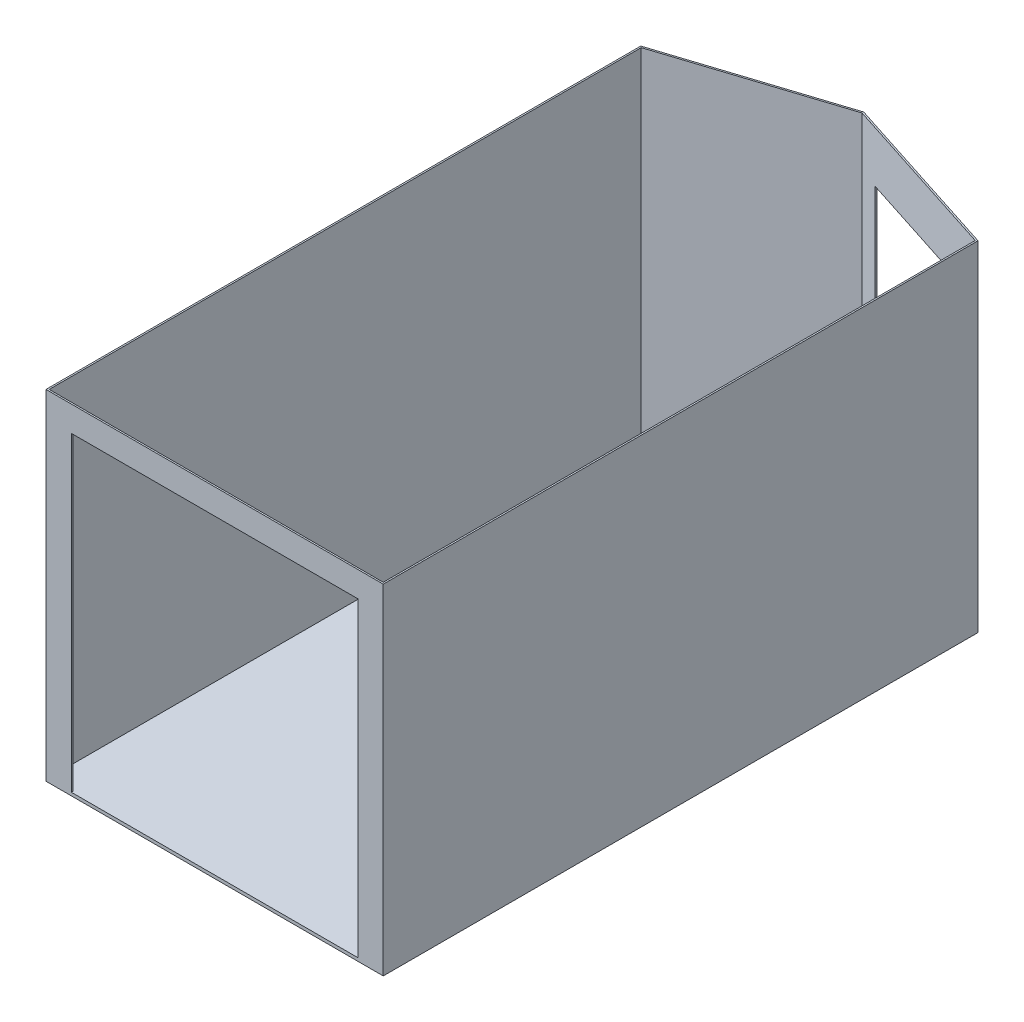
ISO-10303-21;
HEADER;
FILE_DESCRIPTION(('STEP AP214'),'2;1');
FILE_NAME('part.step','',(''),(''),'','','');
FILE_SCHEMA(('AUTOMOTIVE_DESIGN { 1 0 10303 214 1 1 1 1 }'));
ENDSEC;
DATA;
#1=APPLICATION_CONTEXT('core data for automotive mechanical design processes');
#2=APPLICATION_PROTOCOL_DEFINITION('international standard','automotive_design',2000,#1);
#3=PRODUCT_CONTEXT('',#1,'mechanical');
#4=PRODUCT('Part','Part','',(#3));
#5=PRODUCT_RELATED_PRODUCT_CATEGORY('part','',(#4));
#6=PRODUCT_DEFINITION_FORMATION('','',#4);
#7=PRODUCT_DEFINITION_CONTEXT('part definition',#1,'design');
#8=PRODUCT_DEFINITION('design','',#6,#7);
#9=PRODUCT_DEFINITION_SHAPE('','',#8);
#10=(LENGTH_UNIT() NAMED_UNIT(*) SI_UNIT(.MILLI.,.METRE.));
#11=(NAMED_UNIT(*) PLANE_ANGLE_UNIT() SI_UNIT($,.RADIAN.));
#12=(NAMED_UNIT(*) SI_UNIT($,.STERADIAN.) SOLID_ANGLE_UNIT());
#13=UNCERTAINTY_MEASURE_WITH_UNIT(LENGTH_MEASURE(1.E-05),#10,'distance_accuracy_value','');
#14=(GEOMETRIC_REPRESENTATION_CONTEXT(3) GLOBAL_UNCERTAINTY_ASSIGNED_CONTEXT((#13)) GLOBAL_UNIT_ASSIGNED_CONTEXT((#10,
#11,#12)) REPRESENTATION_CONTEXT('',''));
#15=CARTESIAN_POINT('',(0.,0.,0.));
#16=DIRECTION('',(0.,0.,1.));
#17=DIRECTION('',(1.,0.,0.));
#18=AXIS2_PLACEMENT_3D('',#15,#16,#17);
#19=CARTESIAN_POINT('',(0.,2019.3,0.));
#20=DIRECTION('',(0.,1.,0.));
#21=DIRECTION('',(0.,0.,1.));
#22=AXIS2_PLACEMENT_3D('',#19,#20,#21);
#23=PLANE('',#22);
#24=DIRECTION('',(0.,0.,1.));
#25=VECTOR('',#24,1.);
#26=CARTESIAN_POINT('',(-1012.825,2019.3,1787.525));
#27=LINE('',#26,#25);
#28=CARTESIAN_POINT('',(-1012.825,2019.3,-1784.93807702191));
#29=VERTEX_POINT('',#28);
#30=CARTESIAN_POINT('',(-1012.825,2019.3,1787.525));
#31=VERTEX_POINT('',#30);
#32=EDGE_CURVE('E276',#29,#31,#27,.T.);
#33=ORIENTED_EDGE('',*,*,#32,.T.);
#34=DIRECTION('',(1.,0.,0.));
#35=VECTOR('',#34,1.);
#36=CARTESIAN_POINT('',(1012.825,2019.3,1787.525));
#37=LINE('',#36,#35);
#38=CARTESIAN_POINT('',(1012.825,2019.3,1787.525));
#39=VERTEX_POINT('',#38);
#40=EDGE_CURVE('E279',#31,#39,#37,.T.);
#41=ORIENTED_EDGE('',*,*,#40,.T.);
#42=DIRECTION('',(0.,0.,-1.));
#43=VECTOR('',#42,1.);
#44=CARTESIAN_POINT('',(1012.825,2019.3,1787.525));
#45=LINE('',#44,#43);
#46=CARTESIAN_POINT('',(1012.825,2019.3,-1784.93807702191));
#47=VERTEX_POINT('',#46);
#48=EDGE_CURVE('E281',#39,#47,#45,.T.);
#49=ORIENTED_EDGE('',*,*,#48,.T.);
#50=DIRECTION('',(-0.951807228915663,0.,-0.306696917141153));
#51=VECTOR('',#50,1.);
#52=CARTESIAN_POINT('',(3.11816544806831E-13,2019.3,-2111.2964988395));
#53=LINE('',#52,#51);
#54=CARTESIAN_POINT('',(3.11816544806831E-13,2019.3,-2111.2964988395));
#55=VERTEX_POINT('',#54);
#56=EDGE_CURVE('E283',#47,#55,#53,.T.);
#57=ORIENTED_EDGE('',*,*,#56,.T.);
#58=DIRECTION('',(-0.951807228915663,0.,0.306696917141153));
#59=VECTOR('',#58,1.);
#60=CARTESIAN_POINT('',(-1012.825,2019.3,-1784.93807702191));
#61=LINE('',#60,#59);
#62=EDGE_CURVE('E285',#55,#29,#61,.T.);
#63=ORIENTED_EDGE('',*,*,#62,.T.);
#64=EDGE_LOOP('',(#33,#41,#49,#57,#63));
#65=FACE_BOUND('',#64,.T.);
#66=DIRECTION('',(1.,0.,0.));
#67=VECTOR('',#66,1.);
#68=CARTESIAN_POINT('',(1003.3,2019.3,1778.));
#69=LINE('',#68,#67);
#70=CARTESIAN_POINT('',(-1003.3,2019.3,1778.));
#71=VERTEX_POINT('',#70);
#72=CARTESIAN_POINT('',(1003.3,2019.3,1778.));
#73=VERTEX_POINT('',#72);
#74=EDGE_CURVE('E238',#71,#73,#69,.T.);
#75=ORIENTED_EDGE('',*,*,#74,.F.);
#76=DIRECTION('',(0.,0.,1.));
#77=VECTOR('',#76,1.);
#78=CARTESIAN_POINT('',(-1003.3,2019.3,1778.));
#79=LINE('',#78,#77);
#80=CARTESIAN_POINT('',(-1003.3,2019.3,-1778.));
#81=VERTEX_POINT('',#80);
#82=EDGE_CURVE('E236',#81,#71,#79,.T.);
#83=ORIENTED_EDGE('',*,*,#82,.F.);
#84=DIRECTION('',(-0.951807228915663,0.,0.306696917141153));
#85=VECTOR('',#84,1.);
#86=CARTESIAN_POINT('',(-1003.3,2019.3,-1778.));
#87=LINE('',#86,#85);
#88=CARTESIAN_POINT('',(-1.11022302462516E-13,2019.3,-2101.28922035849));
#89=VERTEX_POINT('',#88);
#90=EDGE_CURVE('E246',#89,#81,#87,.T.);
#91=ORIENTED_EDGE('',*,*,#90,.F.);
#92=DIRECTION('',(-0.951807228915663,0.,-0.306696917141153));
#93=VECTOR('',#92,1.);
#94=CARTESIAN_POINT('',(0.,2019.3,-2101.28922035849));
#95=LINE('',#94,#93);
#96=CARTESIAN_POINT('',(1003.3,2019.3,-1778.));
#97=VERTEX_POINT('',#96);
#98=EDGE_CURVE('E243',#97,#89,#95,.T.);
#99=ORIENTED_EDGE('',*,*,#98,.F.);
#100=DIRECTION('',(0.,0.,-1.));
#101=VECTOR('',#100,1.);
#102=CARTESIAN_POINT('',(1003.3,2019.3,1778.));
#103=LINE('',#102,#101);
#104=EDGE_CURVE('E241',#73,#97,#103,.T.);
#105=ORIENTED_EDGE('',*,*,#104,.F.);
#106=EDGE_LOOP('',(#75,#83,#91,#99,#105));
#107=FACE_BOUND('',#106,.T.);
#108=ADVANCED_FACE('F33',(#65,#107),#23,.T.);
#109=CARTESIAN_POINT('',(-1012.825,2019.3,1787.525));
#110=DIRECTION('',(1.,0.,0.));
#111=DIRECTION('',(0.,0.,-1.));
#112=AXIS2_PLACEMENT_3D('',#109,#110,#111);
#113=PLANE('',#112);
#114=DIRECTION('',(0.,-1.,0.));
#115=VECTOR('',#114,1.);
#116=CARTESIAN_POINT('',(-1012.825,2019.3,-1784.93807702191));
#117=LINE('',#116,#115);
#118=CARTESIAN_POINT('',(-1012.825,-19.05,-1784.93807702191));
#119=VERTEX_POINT('',#118);
#120=EDGE_CURVE('E287',#29,#119,#117,.T.);
#121=ORIENTED_EDGE('',*,*,#120,.T.);
#122=DIRECTION('',(0.,0.,-1.));
#123=VECTOR('',#122,1.);
#124=CARTESIAN_POINT('',(-1012.825,-19.05,1787.525));
#125=LINE('',#124,#123);
#126=CARTESIAN_POINT('',(-1012.825,-19.05,1787.525));
#127=VERTEX_POINT('',#126);
#128=EDGE_CURVE('E223',#127,#119,#125,.T.);
#129=ORIENTED_EDGE('',*,*,#128,.F.);
#130=DIRECTION('',(0.,-1.,0.));
#131=VECTOR('',#130,1.);
#132=CARTESIAN_POINT('',(-1012.825,2019.3,1787.525));
#133=LINE('',#132,#131);
#134=EDGE_CURVE('E11',#31,#127,#133,.T.);
#135=ORIENTED_EDGE('',*,*,#134,.F.);
#136=ORIENTED_EDGE('',*,*,#32,.F.);
#137=EDGE_LOOP('',(#121,#129,#135,#136));
#138=FACE_BOUND('',#137,.T.);
#139=ADVANCED_FACE('F35',(#138),#113,.F.);
#140=CARTESIAN_POINT('',(1012.825,2019.3,1787.525));
#141=DIRECTION('',(0.,0.,-1.));
#142=DIRECTION('',(-1.,0.,0.));
#143=AXIS2_PLACEMENT_3D('',#140,#141,#142);
#144=PLANE('',#143);
#145=DIRECTION('',(1.,0.,0.));
#146=VECTOR('',#145,1.);
#147=CARTESIAN_POINT('',(-860.425,0.,1787.525));
#148=LINE('',#147,#146);
#149=CARTESIAN_POINT('',(-860.425,0.,1787.525));
#150=VERTEX_POINT('',#149);
#151=CARTESIAN_POINT('',(860.425,0.,1787.525));
#152=VERTEX_POINT('',#151);
#153=EDGE_CURVE('E179',#150,#152,#148,.T.);
#154=ORIENTED_EDGE('',*,*,#153,.F.);
#155=DIRECTION('',(0.,-1.,0.));
#156=VECTOR('',#155,1.);
#157=CARTESIAN_POINT('',(-860.425,1866.9,1787.525));
#158=LINE('',#157,#156);
#159=CARTESIAN_POINT('',(-860.425,1866.9,1787.525));
#160=VERTEX_POINT('',#159);
#161=EDGE_CURVE('E48',#160,#150,#158,.T.);
#162=ORIENTED_EDGE('',*,*,#161,.F.);
#163=DIRECTION('',(-1.,0.,0.));
#164=VECTOR('',#163,1.);
#165=CARTESIAN_POINT('',(860.425,1866.9,1787.525));
#166=LINE('',#165,#164);
#167=CARTESIAN_POINT('',(860.425,1866.9,1787.525));
#168=VERTEX_POINT('',#167);
#169=EDGE_CURVE('E166',#168,#160,#166,.T.);
#170=ORIENTED_EDGE('',*,*,#169,.F.);
#171=DIRECTION('',(0.,1.,0.));
#172=VECTOR('',#171,1.);
#173=CARTESIAN_POINT('',(860.425,0.,1787.525));
#174=LINE('',#173,#172);
#175=EDGE_CURVE('E174',#152,#168,#174,.T.);
#176=ORIENTED_EDGE('',*,*,#175,.F.);
#177=EDGE_LOOP('',(#154,#162,#170,#176));
#178=FACE_BOUND('',#177,.T.);
#179=ORIENTED_EDGE('',*,*,#134,.T.);
#180=DIRECTION('',(-1.,0.,0.));
#181=VECTOR('',#180,1.);
#182=CARTESIAN_POINT('',(1012.825,-19.05,1787.525));
#183=LINE('',#182,#181);
#184=CARTESIAN_POINT('',(1012.825,-19.05,1787.525));
#185=VERTEX_POINT('',#184);
#186=EDGE_CURVE('E220',#185,#127,#183,.T.);
#187=ORIENTED_EDGE('',*,*,#186,.F.);
#188=DIRECTION('',(0.,-1.,0.));
#189=VECTOR('',#188,1.);
#190=CARTESIAN_POINT('',(1012.825,2019.3,1787.525));
#191=LINE('',#190,#189);
#192=EDGE_CURVE('E41',#39,#185,#191,.T.);
#193=ORIENTED_EDGE('',*,*,#192,.F.);
#194=ORIENTED_EDGE('',*,*,#40,.F.);
#195=EDGE_LOOP('',(#179,#187,#193,#194));
#196=FACE_BOUND('',#195,.T.);
#197=ADVANCED_FACE('F177',(#178,#196),#144,.F.);
#198=CARTESIAN_POINT('',(1012.825,2019.3,1787.525));
#199=DIRECTION('',(-1.,0.,0.));
#200=DIRECTION('',(0.,0.,1.));
#201=AXIS2_PLACEMENT_3D('',#198,#199,#200);
#202=PLANE('',#201);
#203=ORIENTED_EDGE('',*,*,#192,.T.);
#204=DIRECTION('',(0.,0.,1.));
#205=VECTOR('',#204,1.);
#206=CARTESIAN_POINT('',(1012.825,-19.05,-1784.93807702191));
#207=LINE('',#206,#205);
#208=CARTESIAN_POINT('',(1012.825,-19.05,-1784.93807702191));
#209=VERTEX_POINT('',#208);
#210=EDGE_CURVE('E232',#209,#185,#207,.T.);
#211=ORIENTED_EDGE('',*,*,#210,.F.);
#212=DIRECTION('',(0.,-1.,0.));
#213=VECTOR('',#212,1.);
#214=CARTESIAN_POINT('',(1012.825,2019.3,-1784.93807702191));
#215=LINE('',#214,#213);
#216=EDGE_CURVE('E291',#47,#209,#215,.T.);
#217=ORIENTED_EDGE('',*,*,#216,.F.);
#218=ORIENTED_EDGE('',*,*,#48,.F.);
#219=EDGE_LOOP('',(#203,#211,#217,#218));
#220=FACE_BOUND('',#219,.T.);
#221=ADVANCED_FACE('F296',(#220),#202,.F.);
#222=CARTESIAN_POINT('',(3.11816544806831E-13,2019.3,-2111.2964988395));
#223=DIRECTION('',(-0.306696917141153,0.,0.951807228915663));
#224=DIRECTION('',(0.951807228915663,0.,0.306696917141153));
#225=AXIS2_PLACEMENT_3D('',#222,#223,#224);
#226=PLANE('',#225);
#227=DIRECTION('',(0.,-1.,0.));
#228=VECTOR('',#227,1.);
#229=CARTESIAN_POINT('',(892.949039059366,1714.5,-1823.56521342401));
#230=LINE('',#229,#228);
#231=CARTESIAN_POINT('',(892.949039059366,1714.5,-1823.56521342401));
#232=VERTEX_POINT('',#231);
#233=CARTESIAN_POINT('',(892.949039059366,0.,-1823.56521342401));
#234=VERTEX_POINT('',#233);
#235=EDGE_CURVE('E203',#232,#234,#230,.T.);
#236=ORIENTED_EDGE('',*,*,#235,.F.);
#237=DIRECTION('',(0.951807228915663,0.,0.306696917141153));
#238=VECTOR('',#237,1.);
#239=CARTESIAN_POINT('',(119.320123396716,1714.5,-2072.84846767634));
#240=LINE('',#239,#238);
#241=CARTESIAN_POINT('',(119.320123396716,1714.5,-2072.84846767634));
#242=VERTEX_POINT('',#241);
#243=EDGE_CURVE('E200',#242,#232,#240,.T.);
#244=ORIENTED_EDGE('',*,*,#243,.F.);
#245=DIRECTION('',(0.,1.,0.));
#246=VECTOR('',#245,1.);
#247=CARTESIAN_POINT('',(119.320123396716,0.,-2072.84846767634));
#248=LINE('',#247,#246);
#249=CARTESIAN_POINT('',(119.320123396716,0.,-2072.84846767634));
#250=VERTEX_POINT('',#249);
#251=EDGE_CURVE('E197',#250,#242,#248,.T.);
#252=ORIENTED_EDGE('',*,*,#251,.F.);
#253=DIRECTION('',(-0.951807228915663,0.,-0.306696917141153));
#254=VECTOR('',#253,1.);
#255=CARTESIAN_POINT('',(892.949039059366,0.,-1823.56521342401));
#256=LINE('',#255,#254);
#257=EDGE_CURVE('E206',#234,#250,#256,.T.);
#258=ORIENTED_EDGE('',*,*,#257,.F.);
#259=EDGE_LOOP('',(#236,#244,#252,#258));
#260=FACE_BOUND('',#259,.T.);
#261=ORIENTED_EDGE('',*,*,#216,.T.);
#262=DIRECTION('',(0.951807228915663,0.,0.306696917141153));
#263=VECTOR('',#262,1.);
#264=CARTESIAN_POINT('',(3.11816544806831E-13,-19.05,-2111.2964988395));
#265=LINE('',#264,#263);
#266=CARTESIAN_POINT('',(3.11816544806831E-13,-19.05,-2111.2964988395));
#267=VERTEX_POINT('',#266);
#268=EDGE_CURVE('E229',#267,#209,#265,.T.);
#269=ORIENTED_EDGE('',*,*,#268,.F.);
#270=DIRECTION('',(0.,-1.,0.));
#271=VECTOR('',#270,1.);
#272=CARTESIAN_POINT('',(3.11816544806831E-13,2019.3,-2111.2964988395));
#273=LINE('',#272,#271);
#274=EDGE_CURVE('E289',#55,#267,#273,.T.);
#275=ORIENTED_EDGE('',*,*,#274,.F.);
#276=ORIENTED_EDGE('',*,*,#56,.F.);
#277=EDGE_LOOP('',(#261,#269,#275,#276));
#278=FACE_BOUND('',#277,.T.);
#279=ADVANCED_FACE('F314',(#260,#278),#226,.F.);
#280=CARTESIAN_POINT('',(-1012.825,2019.3,-1784.93807702191));
#281=DIRECTION('',(0.306696917141153,0.,0.951807228915663));
#282=DIRECTION('',(0.951807228915663,0.,-0.306696917141153));
#283=AXIS2_PLACEMENT_3D('',#280,#281,#282);
#284=PLANE('',#283);
#285=ORIENTED_EDGE('',*,*,#274,.T.);
#286=DIRECTION('',(0.951807228915663,0.,-0.306696917141153));
#287=VECTOR('',#286,1.);
#288=CARTESIAN_POINT('',(-1012.825,-19.05,-1784.93807702191));
#289=LINE('',#288,#287);
#290=EDGE_CURVE('E226',#119,#267,#289,.T.);
#291=ORIENTED_EDGE('',*,*,#290,.F.);
#292=ORIENTED_EDGE('',*,*,#120,.F.);
#293=ORIENTED_EDGE('',*,*,#62,.F.);
#294=EDGE_LOOP('',(#285,#291,#292,#293));
#295=FACE_BOUND('',#294,.T.);
#296=ADVANCED_FACE('F309',(#295),#284,.F.);
#297=CARTESIAN_POINT('',(-1003.3,2019.3,1778.));
#298=DIRECTION('',(1.,0.,0.));
#299=DIRECTION('',(0.,0.,-1.));
#300=AXIS2_PLACEMENT_3D('',#297,#298,#299);
#301=PLANE('',#300);
#302=DIRECTION('',(0.,0.,1.));
#303=VECTOR('',#302,1.);
#304=CARTESIAN_POINT('',(-1003.3,0.,1778.));
#305=LINE('',#304,#303);
#306=CARTESIAN_POINT('',(-1003.3,0.,-1778.));
#307=VERTEX_POINT('',#306);
#308=CARTESIAN_POINT('',(-1003.3,0.,1778.));
#309=VERTEX_POINT('',#308);
#310=EDGE_CURVE('E235',#307,#309,#305,.T.);
#311=ORIENTED_EDGE('',*,*,#310,.F.);
#312=DIRECTION('',(0.,-1.,0.));
#313=VECTOR('',#312,1.);
#314=CARTESIAN_POINT('',(-1003.3,2019.3,-1778.));
#315=LINE('',#314,#313);
#316=EDGE_CURVE('E248',#81,#307,#315,.T.);
#317=ORIENTED_EDGE('',*,*,#316,.F.);
#318=ORIENTED_EDGE('',*,*,#82,.T.);
#319=DIRECTION('',(0.,-1.,0.));
#320=VECTOR('',#319,1.);
#321=CARTESIAN_POINT('',(-1003.3,2019.3,1778.));
#322=LINE('',#321,#320);
#323=EDGE_CURVE('E273',#71,#309,#322,.T.);
#324=ORIENTED_EDGE('',*,*,#323,.T.);
#325=EDGE_LOOP('',(#311,#317,#318,#324));
#326=FACE_BOUND('',#325,.T.);
#327=ADVANCED_FACE('F339',(#326),#301,.T.);
#328=CARTESIAN_POINT('',(1003.3,2019.3,1778.));
#329=DIRECTION('',(0.,0.,-1.));
#330=DIRECTION('',(-1.,0.,0.));
#331=AXIS2_PLACEMENT_3D('',#328,#329,#330);
#332=PLANE('',#331);
#333=DIRECTION('',(0.,-1.,0.));
#334=VECTOR('',#333,1.);
#335=CARTESIAN_POINT('',(-860.425,1866.9,1778.));
#336=LINE('',#335,#334);
#337=CARTESIAN_POINT('',(-860.425,1866.9,1778.));
#338=VERTEX_POINT('',#337);
#339=CARTESIAN_POINT('',(-860.425,0.,1778.));
#340=VERTEX_POINT('',#339);
#341=EDGE_CURVE('E159',#338,#340,#336,.T.);
#342=ORIENTED_EDGE('',*,*,#341,.T.);
#343=DIRECTION('',(1.,0.,0.));
#344=VECTOR('',#343,1.);
#345=CARTESIAN_POINT('',(1003.3,0.,1778.));
#346=LINE('',#345,#344);
#347=EDGE_CURVE('E252',#309,#340,#346,.T.);
#348=ORIENTED_EDGE('',*,*,#347,.F.);
#349=ORIENTED_EDGE('',*,*,#323,.F.);
#350=ORIENTED_EDGE('',*,*,#74,.T.);
#351=DIRECTION('',(0.,-1.,0.));
#352=VECTOR('',#351,1.);
#353=CARTESIAN_POINT('',(1003.3,2019.3,1778.));
#354=LINE('',#353,#352);
#355=CARTESIAN_POINT('',(1003.3,0.,1778.));
#356=VERTEX_POINT('',#355);
#357=EDGE_CURVE('E270',#73,#356,#354,.T.);
#358=ORIENTED_EDGE('',*,*,#357,.T.);
#359=CARTESIAN_POINT('',(860.425,0.,1778.));
#360=VERTEX_POINT('',#359);
#361=EDGE_CURVE('E251',#360,#356,#346,.T.);
#362=ORIENTED_EDGE('',*,*,#361,.F.);
#363=DIRECTION('',(0.,1.,0.));
#364=VECTOR('',#363,1.);
#365=CARTESIAN_POINT('',(860.425,0.,1778.));
#366=LINE('',#365,#364);
#367=CARTESIAN_POINT('',(860.425,1866.9,1778.));
#368=VERTEX_POINT('',#367);
#369=EDGE_CURVE('E162',#360,#368,#366,.T.);
#370=ORIENTED_EDGE('',*,*,#369,.T.);
#371=DIRECTION('',(-1.,0.,0.));
#372=VECTOR('',#371,1.);
#373=CARTESIAN_POINT('',(860.425000000001,1866.9,1778.));
#374=LINE('',#373,#372);
#375=EDGE_CURVE('E163',#368,#338,#374,.T.);
#376=ORIENTED_EDGE('',*,*,#375,.T.);
#377=EDGE_LOOP('',(#342,#348,#349,#350,#358,#362,#370,#376));
#378=FACE_BOUND('',#377,.T.);
#379=ADVANCED_FACE('F327',(#378),#332,.T.);
#380=CARTESIAN_POINT('',(1003.3,2019.3,1778.));
#381=DIRECTION('',(-1.,0.,0.));
#382=DIRECTION('',(0.,0.,1.));
#383=AXIS2_PLACEMENT_3D('',#380,#381,#382);
#384=PLANE('',#383);
#385=DIRECTION('',(0.,0.,-1.));
#386=VECTOR('',#385,1.);
#387=CARTESIAN_POINT('',(1003.3,0.,1778.));
#388=LINE('',#387,#386);
#389=CARTESIAN_POINT('',(1003.3,0.,-1778.));
#390=VERTEX_POINT('',#389);
#391=EDGE_CURVE('E255',#356,#390,#388,.T.);
#392=ORIENTED_EDGE('',*,*,#391,.F.);
#393=ORIENTED_EDGE('',*,*,#357,.F.);
#394=ORIENTED_EDGE('',*,*,#104,.T.);
#395=DIRECTION('',(0.,-1.,0.));
#396=VECTOR('',#395,1.);
#397=CARTESIAN_POINT('',(1003.3,2019.3,-1778.));
#398=LINE('',#397,#396);
#399=EDGE_CURVE('E268',#97,#390,#398,.T.);
#400=ORIENTED_EDGE('',*,*,#399,.T.);
#401=EDGE_LOOP('',(#392,#393,#394,#400));
#402=FACE_BOUND('',#401,.T.);
#403=ADVANCED_FACE('F331',(#402),#384,.T.);
#404=CARTESIAN_POINT('',(0.,2019.3,-2101.28922035849));
#405=DIRECTION('',(-0.306696917141153,0.,0.951807228915663));
#406=DIRECTION('',(0.951807228915663,0.,0.306696917141153));
#407=AXIS2_PLACEMENT_3D('',#404,#405,#406);
#408=PLANE('',#407);
#409=DIRECTION('',(0.,-1.,0.));
#410=VECTOR('',#409,1.);
#411=CARTESIAN_POINT('',(890.027750923597,1714.5,-1814.49924956859));
#412=LINE('',#411,#410);
#413=CARTESIAN_POINT('',(890.027750923596,1714.5,-1814.49924956859));
#414=VERTEX_POINT('',#413);
#415=CARTESIAN_POINT('',(890.027750923596,0.,-1814.49924956859));
#416=VERTEX_POINT('',#415);
#417=EDGE_CURVE('E173',#414,#416,#412,.T.);
#418=ORIENTED_EDGE('',*,*,#417,.T.);
#419=DIRECTION('',(-0.951807228915663,0.,-0.306696917141153));
#420=VECTOR('',#419,1.);
#421=CARTESIAN_POINT('',(0.,0.,-2101.28922035849));
#422=LINE('',#421,#420);
#423=EDGE_CURVE('E259',#390,#416,#422,.T.);
#424=ORIENTED_EDGE('',*,*,#423,.F.);
#425=ORIENTED_EDGE('',*,*,#399,.F.);
#426=ORIENTED_EDGE('',*,*,#98,.T.);
#427=DIRECTION('',(0.,-1.,0.));
#428=VECTOR('',#427,1.);
#429=CARTESIAN_POINT('',(0.,2019.3,-2101.28922035849));
#430=LINE('',#429,#428);
#431=CARTESIAN_POINT('',(0.,0.,-2101.28922035849));
#432=VERTEX_POINT('',#431);
#433=EDGE_CURVE('E265',#89,#432,#430,.T.);
#434=ORIENTED_EDGE('',*,*,#433,.T.);
#435=CARTESIAN_POINT('',(116.398835260946,0.,-2063.78250382092));
#436=VERTEX_POINT('',#435);
#437=EDGE_CURVE('E258',#436,#432,#422,.T.);
#438=ORIENTED_EDGE('',*,*,#437,.F.);
#439=DIRECTION('',(0.,1.,0.));
#440=VECTOR('',#439,1.);
#441=CARTESIAN_POINT('',(116.398835260946,0.,-2063.78250382092));
#442=LINE('',#441,#440);
#443=CARTESIAN_POINT('',(116.398835260946,1714.5,-2063.78250382092));
#444=VERTEX_POINT('',#443);
#445=EDGE_CURVE('E194',#436,#444,#442,.T.);
#446=ORIENTED_EDGE('',*,*,#445,.T.);
#447=DIRECTION('',(0.951807228915663,0.,0.306696917141153));
#448=VECTOR('',#447,1.);
#449=CARTESIAN_POINT('',(116.398835260946,1714.5,-2063.78250382092));
#450=LINE('',#449,#448);
#451=EDGE_CURVE('E212',#444,#414,#450,.T.);
#452=ORIENTED_EDGE('',*,*,#451,.T.);
#453=EDGE_LOOP('',(#418,#424,#425,#426,#434,#438,#446,#452));
#454=FACE_BOUND('',#453,.T.);
#455=ADVANCED_FACE('F346',(#454),#408,.T.);
#456=CARTESIAN_POINT('',(-1003.3,2019.3,-1778.));
#457=DIRECTION('',(0.306696917141153,0.,0.951807228915663));
#458=DIRECTION('',(0.951807228915663,0.,-0.306696917141153));
#459=AXIS2_PLACEMENT_3D('',#456,#457,#458);
#460=PLANE('',#459);
#461=DIRECTION('',(-0.951807228915663,0.,0.306696917141153));
#462=VECTOR('',#461,1.);
#463=CARTESIAN_POINT('',(-1003.3,0.,-1778.));
#464=LINE('',#463,#462);
#465=EDGE_CURVE('E239',#432,#307,#464,.T.);
#466=ORIENTED_EDGE('',*,*,#465,.F.);
#467=ORIENTED_EDGE('',*,*,#433,.F.);
#468=ORIENTED_EDGE('',*,*,#90,.T.);
#469=ORIENTED_EDGE('',*,*,#316,.T.);
#470=EDGE_LOOP('',(#466,#467,#468,#469));
#471=FACE_BOUND('',#470,.T.);
#472=ADVANCED_FACE('F344',(#471),#460,.T.);
#473=CARTESIAN_POINT('',(0.,0.,0.));
#474=DIRECTION('',(0.,-1.,0.));
#475=DIRECTION('',(0.,0.,-1.));
#476=AXIS2_PLACEMENT_3D('',#473,#474,#475);
#477=PLANE('',#476);
#478=ORIENTED_EDGE('',*,*,#465,.T.);
#479=ORIENTED_EDGE('',*,*,#310,.T.);
#480=ORIENTED_EDGE('',*,*,#347,.T.);
#481=DIRECTION('',(0.,0.,1.));
#482=VECTOR('',#481,1.);
#483=CARTESIAN_POINT('',(-860.425,0.,-2111.2974988395));
#484=LINE('',#483,#482);
#485=EDGE_CURVE('E186',#340,#150,#484,.T.);
#486=ORIENTED_EDGE('',*,*,#485,.T.);
#487=ORIENTED_EDGE('',*,*,#153,.T.);
#488=DIRECTION('',(0.,0.,1.));
#489=VECTOR('',#488,1.);
#490=CARTESIAN_POINT('',(860.425,0.,-2111.2974988395));
#491=LINE('',#490,#489);
#492=EDGE_CURVE('E56',#360,#152,#491,.T.);
#493=ORIENTED_EDGE('',*,*,#492,.F.);
#494=ORIENTED_EDGE('',*,*,#361,.T.);
#495=ORIENTED_EDGE('',*,*,#391,.T.);
#496=ORIENTED_EDGE('',*,*,#423,.T.);
#497=DIRECTION('',(0.306696917141153,0.,-0.951807228915663));
#498=VECTOR('',#497,1.);
#499=CARTESIAN_POINT('',(-340.450417119329,0.,2004.18281050292));
#500=LINE('',#499,#498);
#501=EDGE_CURVE('E213',#416,#234,#500,.T.);
#502=ORIENTED_EDGE('',*,*,#501,.T.);
#503=ORIENTED_EDGE('',*,*,#257,.T.);
#504=DIRECTION('',(0.306696917141153,0.,-0.951807228915663));
#505=VECTOR('',#504,1.);
#506=CARTESIAN_POINT('',(-1114.07933278198,0.,1754.89955625059));
#507=LINE('',#506,#505);
#508=EDGE_CURVE('E209',#436,#250,#507,.T.);
#509=ORIENTED_EDGE('',*,*,#508,.F.);
#510=ORIENTED_EDGE('',*,*,#437,.T.);
#511=EDGE_LOOP('',(#478,#479,#480,#486,#487,#493,#494,#495,#496,#502,#503,#509,#510));
#512=FACE_BOUND('',#511,.T.);
#513=ADVANCED_FACE('F334',(#512),#477,.F.);
#514=CARTESIAN_POINT('',(0.,-19.05,0.));
#515=DIRECTION('',(0.,-1.,0.));
#516=DIRECTION('',(0.,0.,-1.));
#517=AXIS2_PLACEMENT_3D('',#514,#515,#516);
#518=PLANE('',#517);
#519=ORIENTED_EDGE('',*,*,#186,.T.);
#520=ORIENTED_EDGE('',*,*,#128,.T.);
#521=ORIENTED_EDGE('',*,*,#290,.T.);
#522=ORIENTED_EDGE('',*,*,#268,.T.);
#523=ORIENTED_EDGE('',*,*,#210,.T.);
#524=EDGE_LOOP('',(#519,#520,#521,#522,#523));
#525=FACE_BOUND('',#524,.T.);
#526=ADVANCED_FACE('F300',(#525),#518,.T.);
#527=CARTESIAN_POINT('',(-1114.07933278198,1714.5,1754.89955625059));
#528=DIRECTION('',(0.,1.,0.));
#529=DIRECTION('',(-1.,0.,0.));
#530=AXIS2_PLACEMENT_3D('',#527,#528,#529);
#531=PLANE('',#530);
#532=DIRECTION('',(0.306696917141153,0.,-0.951807228915663));
#533=VECTOR('',#532,1.);
#534=CARTESIAN_POINT('',(-1114.07933278198,1714.5,1754.89955625059));
#535=LINE('',#534,#533);
#536=EDGE_CURVE('E208',#444,#242,#535,.T.);
#537=ORIENTED_EDGE('',*,*,#536,.T.);
#538=ORIENTED_EDGE('',*,*,#243,.T.);
#539=DIRECTION('',(0.306696917141153,0.,-0.951807228915663));
#540=VECTOR('',#539,1.);
#541=CARTESIAN_POINT('',(-340.450417119329,1714.5,2004.18281050292));
#542=LINE('',#541,#540);
#543=EDGE_CURVE('E215',#414,#232,#542,.T.);
#544=ORIENTED_EDGE('',*,*,#543,.F.);
#545=ORIENTED_EDGE('',*,*,#451,.F.);
#546=EDGE_LOOP('',(#537,#538,#544,#545));
#547=FACE_BOUND('',#546,.T.);
#548=ADVANCED_FACE('F351',(#547),#531,.F.);
#549=CARTESIAN_POINT('',(-340.450417119329,1714.5,2004.18281050292));
#550=DIRECTION('',(0.951807228915663,0.,0.306696917141153));
#551=DIRECTION('',(0.306696917141153,0.,-0.951807228915663));
#552=AXIS2_PLACEMENT_3D('',#549,#550,#551);
#553=PLANE('',#552);
#554=ORIENTED_EDGE('',*,*,#543,.T.);
#555=ORIENTED_EDGE('',*,*,#235,.T.);
#556=ORIENTED_EDGE('',*,*,#501,.F.);
#557=ORIENTED_EDGE('',*,*,#417,.F.);
#558=EDGE_LOOP('',(#554,#555,#556,#557));
#559=FACE_BOUND('',#558,.T.);
#560=ADVANCED_FACE('F349',(#559),#553,.F.);
#561=CARTESIAN_POINT('',(-1114.07933278198,0.,1754.89955625059));
#562=DIRECTION('',(-0.951807228915663,0.,-0.306696917141153));
#563=DIRECTION('',(-0.306696917141153,0.,0.951807228915663));
#564=AXIS2_PLACEMENT_3D('',#561,#562,#563);
#565=PLANE('',#564);
#566=ORIENTED_EDGE('',*,*,#508,.T.);
#567=ORIENTED_EDGE('',*,*,#251,.T.);
#568=ORIENTED_EDGE('',*,*,#536,.F.);
#569=ORIENTED_EDGE('',*,*,#445,.F.);
#570=EDGE_LOOP('',(#566,#567,#568,#569));
#571=FACE_BOUND('',#570,.T.);
#572=ADVANCED_FACE('F360',(#571),#565,.F.);
#573=CARTESIAN_POINT('',(-860.425,1866.9,-2111.2974988395));
#574=DIRECTION('',(-1.,0.,0.));
#575=DIRECTION('',(0.,0.,1.));
#576=AXIS2_PLACEMENT_3D('',#573,#574,#575);
#577=PLANE('',#576);
#578=DIRECTION('',(0.,0.,1.));
#579=VECTOR('',#578,1.);
#580=CARTESIAN_POINT('',(-860.425,1866.9,-2111.2974988395));
#581=LINE('',#580,#579);
#582=EDGE_CURVE('E155',#338,#160,#581,.T.);
#583=ORIENTED_EDGE('',*,*,#582,.T.);
#584=ORIENTED_EDGE('',*,*,#161,.T.);
#585=ORIENTED_EDGE('',*,*,#485,.F.);
#586=ORIENTED_EDGE('',*,*,#341,.F.);
#587=EDGE_LOOP('',(#583,#584,#585,#586));
#588=FACE_BOUND('',#587,.T.);
#589=ADVANCED_FACE('F157',(#588),#577,.F.);
#590=CARTESIAN_POINT('',(860.425,1866.9,-2111.2974988395));
#591=DIRECTION('',(0.,1.,0.));
#592=DIRECTION('',(0.,0.,1.));
#593=AXIS2_PLACEMENT_3D('',#590,#591,#592);
#594=PLANE('',#593);
#595=DIRECTION('',(0.,0.,1.));
#596=VECTOR('',#595,1.);
#597=CARTESIAN_POINT('',(860.425,1866.9,-2111.2974988395));
#598=LINE('',#597,#596);
#599=EDGE_CURVE('E169',#368,#168,#598,.T.);
#600=ORIENTED_EDGE('',*,*,#599,.T.);
#601=ORIENTED_EDGE('',*,*,#169,.T.);
#602=ORIENTED_EDGE('',*,*,#582,.F.);
#603=ORIENTED_EDGE('',*,*,#375,.F.);
#604=EDGE_LOOP('',(#600,#601,#602,#603));
#605=FACE_BOUND('',#604,.T.);
#606=ADVANCED_FACE('F167',(#605),#594,.F.);
#607=CARTESIAN_POINT('',(860.425,0.,-2111.2974988395));
#608=DIRECTION('',(1.,0.,0.));
#609=DIRECTION('',(0.,1.,0.));
#610=AXIS2_PLACEMENT_3D('',#607,#608,#609);
#611=PLANE('',#610);
#612=ORIENTED_EDGE('',*,*,#492,.T.);
#613=ORIENTED_EDGE('',*,*,#175,.T.);
#614=ORIENTED_EDGE('',*,*,#599,.F.);
#615=ORIENTED_EDGE('',*,*,#369,.F.);
#616=EDGE_LOOP('',(#612,#613,#614,#615));
#617=FACE_BOUND('',#616,.T.);
#618=ADVANCED_FACE('F336',(#617),#611,.F.);
#619=CLOSED_SHELL('',(#108,#139,#197,#221,#279,#296,#327,#379,#403,#455,#472,#513,#526,#548,
#560,#572,#589,#606,#618));
#620=MANIFOLD_SOLID_BREP('B2',#619);
#621=ADVANCED_BREP_SHAPE_REPRESENTATION('',(#18,#620),#14);
#622=SHAPE_DEFINITION_REPRESENTATION(#9,#621);
ENDSEC;
END-ISO-10303-21;
